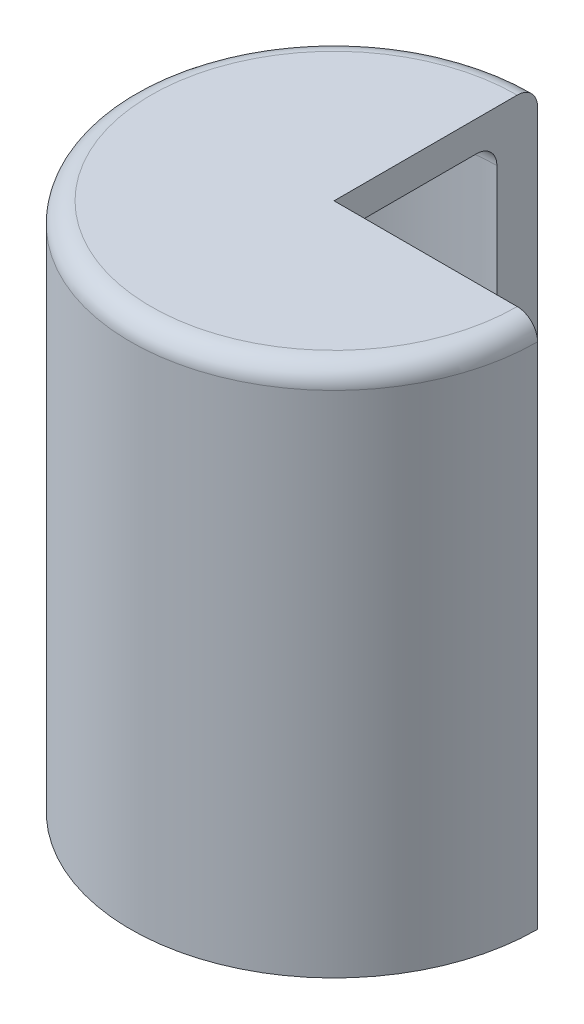
ISO-10303-21;
HEADER;
FILE_DESCRIPTION(('STEP AP214'),'2;1');
FILE_NAME('part.step','',(''),(''),'','','');
FILE_SCHEMA(('AUTOMOTIVE_DESIGN { 1 0 10303 214 1 1 1 1 }'));
ENDSEC;
DATA;
#1=APPLICATION_CONTEXT('core data for automotive mechanical design processes');
#2=APPLICATION_PROTOCOL_DEFINITION('international standard','automotive_design',2000,#1);
#3=PRODUCT_CONTEXT('',#1,'mechanical');
#4=PRODUCT('Part','Part','',(#3));
#5=PRODUCT_RELATED_PRODUCT_CATEGORY('part','',(#4));
#6=PRODUCT_DEFINITION_FORMATION('','',#4);
#7=PRODUCT_DEFINITION_CONTEXT('part definition',#1,'design');
#8=PRODUCT_DEFINITION('design','',#6,#7);
#9=PRODUCT_DEFINITION_SHAPE('','',#8);
#10=(LENGTH_UNIT() NAMED_UNIT(*) SI_UNIT(.MILLI.,.METRE.));
#11=(NAMED_UNIT(*) PLANE_ANGLE_UNIT() SI_UNIT($,.RADIAN.));
#12=(NAMED_UNIT(*) SI_UNIT($,.STERADIAN.) SOLID_ANGLE_UNIT());
#13=UNCERTAINTY_MEASURE_WITH_UNIT(LENGTH_MEASURE(1.E-05),#10,'distance_accuracy_value','');
#14=(GEOMETRIC_REPRESENTATION_CONTEXT(3) GLOBAL_UNCERTAINTY_ASSIGNED_CONTEXT((#13)) GLOBAL_UNIT_ASSIGNED_CONTEXT((#10,
#11,#12)) REPRESENTATION_CONTEXT('',''));
#15=CARTESIAN_POINT('',(0.,0.,0.));
#16=DIRECTION('',(0.,0.,1.));
#17=DIRECTION('',(1.,0.,0.));
#18=AXIS2_PLACEMENT_3D('',#15,#16,#17);
#19=CARTESIAN_POINT('',(0.,40.2884289109046,0.));
#20=DIRECTION('',(0.,1.,0.));
#21=DIRECTION('',(0.,0.,1.));
#22=AXIS2_PLACEMENT_3D('',#19,#20,#21);
#23=PLANE('',#22);
#24=CARTESIAN_POINT('',(0.,40.2884289109046,0.));
#25=DIRECTION('',(0.,1.,0.));
#26=DIRECTION('',(0.,0.,1.));
#27=AXIS2_PLACEMENT_3D('',#24,#25,#26);
#28=CIRCLE('',#27,70.);
#29=CARTESIAN_POINT('',(7.33211081157058E-13,40.2884289109046,-70.));
#30=VERTEX_POINT('',#29);
#31=CARTESIAN_POINT('',(70.,40.2884289109046,0.));
#32=VERTEX_POINT('',#31);
#33=EDGE_CURVE('E11',#30,#32,#28,.T.);
#34=ORIENTED_EDGE('',*,*,#33,.F.);
#35=DIRECTION('',(0.,0.,-1.));
#36=VECTOR('',#35,1.);
#37=CARTESIAN_POINT('',(0.,40.2884289109046,0.));
#38=LINE('',#37,#36);
#39=CARTESIAN_POINT('',(0.,40.2884289109046,0.));
#40=VERTEX_POINT('',#39);
#41=EDGE_CURVE('E107',#40,#30,#38,.T.);
#42=ORIENTED_EDGE('',*,*,#41,.F.);
#43=DIRECTION('',(1.,0.,0.));
#44=VECTOR('',#43,1.);
#45=CARTESIAN_POINT('',(0.,40.2884289109046,0.));
#46=LINE('',#45,#44);
#47=EDGE_CURVE('E106',#40,#32,#46,.T.);
#48=ORIENTED_EDGE('',*,*,#47,.T.);
#49=EDGE_LOOP('',(#34,#42,#48));
#50=FACE_BOUND('',#49,.T.);
#51=ADVANCED_FACE('F37',(#50),#23,.F.);
#52=CARTESIAN_POINT('',(0.,30.2884289109046,0.));
#53=DIRECTION('',(0.,1.,0.));
#54=DIRECTION('',(0.,0.,1.));
#55=AXIS2_PLACEMENT_3D('',#52,#53,#54);
#56=TOROIDAL_SURFACE('',#55,70.,10.);
#57=CARTESIAN_POINT('',(0.,30.2884289109046,0.));
#58=DIRECTION('',(0.,1.,0.));
#59=DIRECTION('',(0.,0.,1.));
#60=AXIS2_PLACEMENT_3D('',#57,#58,#59);
#61=CIRCLE('',#60,80.);
#62=CARTESIAN_POINT('',(8.37955521322352E-13,30.2884289109046,-80.));
#63=VERTEX_POINT('',#62);
#64=CARTESIAN_POINT('',(80.,30.2884289109046,0.));
#65=VERTEX_POINT('',#64);
#66=EDGE_CURVE('E44',#63,#65,#61,.T.);
#67=ORIENTED_EDGE('',*,*,#66,.F.);
#68=CARTESIAN_POINT('',(7.33211081157058E-13,30.2884289109046,-70.));
#69=DIRECTION('',(-1.,0.,0.));
#70=DIRECTION('',(0.,0.,-1.));
#71=AXIS2_PLACEMENT_3D('',#68,#69,#70);
#72=CIRCLE('',#71,10.);
#73=EDGE_CURVE('E102',#30,#63,#72,.T.);
#74=ORIENTED_EDGE('',*,*,#73,.F.);
#75=ORIENTED_EDGE('',*,*,#33,.T.);
#76=CARTESIAN_POINT('',(70.,30.2884289109046,0.));
#77=DIRECTION('',(0.,0.,-1.));
#78=DIRECTION('',(1.,0.,0.));
#79=AXIS2_PLACEMENT_3D('',#76,#77,#78);
#80=CIRCLE('',#79,10.);
#81=EDGE_CURVE('E99',#32,#65,#80,.T.);
#82=ORIENTED_EDGE('',*,*,#81,.T.);
#83=EDGE_LOOP('',(#67,#74,#75,#82));
#84=FACE_BOUND('',#83,.T.);
#85=ADVANCED_FACE('F97',(#84),#56,.F.);
#86=CARTESIAN_POINT('',(0.,40.2884289109046,0.));
#87=DIRECTION('',(0.,1.,0.));
#88=DIRECTION('',(0.,0.,1.));
#89=AXIS2_PLACEMENT_3D('',#86,#87,#88);
#90=CYLINDRICAL_SURFACE('',#89,80.);
#91=CARTESIAN_POINT('',(0.,-204.742322884468,0.));
#92=DIRECTION('',(0.,1.,0.));
#93=DIRECTION('',(0.,0.,1.));
#94=AXIS2_PLACEMENT_3D('',#91,#92,#93);
#95=CIRCLE('',#94,80.);
#96=CARTESIAN_POINT('',(8.37955521322352E-13,-204.742322884468,-80.));
#97=VERTEX_POINT('',#96);
#98=CARTESIAN_POINT('',(80.,-204.742322884468,0.));
#99=VERTEX_POINT('',#98);
#100=EDGE_CURVE('E150',#97,#99,#95,.T.);
#101=ORIENTED_EDGE('',*,*,#100,.F.);
#102=DIRECTION('',(0.,-1.,0.));
#103=VECTOR('',#102,1.);
#104=CARTESIAN_POINT('',(8.37955521322352E-13,30.2884289109046,-80.));
#105=LINE('',#104,#103);
#106=EDGE_CURVE('E131',#63,#97,#105,.T.);
#107=ORIENTED_EDGE('',*,*,#106,.F.);
#108=ORIENTED_EDGE('',*,*,#66,.T.);
#109=DIRECTION('',(0.,-1.,0.));
#110=VECTOR('',#109,1.);
#111=CARTESIAN_POINT('',(80.,30.2884289109046,0.));
#112=LINE('',#111,#110);
#113=EDGE_CURVE('E114',#65,#99,#112,.T.);
#114=ORIENTED_EDGE('',*,*,#113,.T.);
#115=EDGE_LOOP('',(#101,#107,#108,#114));
#116=FACE_BOUND('',#115,.T.);
#117=ADVANCED_FACE('F153',(#116),#90,.F.);
#118=CARTESIAN_POINT('',(8.37955521322352E-13,-204.742322884468,-80.));
#119=DIRECTION('',(0.,1.,0.));
#120=DIRECTION('',(0.,0.,1.));
#121=AXIS2_PLACEMENT_3D('',#118,#119,#120);
#122=PLANE('',#121);
#123=CARTESIAN_POINT('',(0.,-204.742322884468,0.));
#124=DIRECTION('',(0.,1.,0.));
#125=DIRECTION('',(0.,0.,1.));
#126=AXIS2_PLACEMENT_3D('',#123,#124,#125);
#127=CIRCLE('',#126,100.);
#128=CARTESIAN_POINT('',(1.04744440165294E-12,-204.742322884468,-100.));
#129=VERTEX_POINT('',#128);
#130=CARTESIAN_POINT('',(100.,-204.742322884468,0.));
#131=VERTEX_POINT('',#130);
#132=EDGE_CURVE('E148',#129,#131,#127,.T.);
#133=ORIENTED_EDGE('',*,*,#132,.F.);
#134=DIRECTION('',(0.,0.,-1.));
#135=VECTOR('',#134,1.);
#136=CARTESIAN_POINT('',(8.37955521322352E-13,-204.742322884468,-80.));
#137=LINE('',#136,#135);
#138=EDGE_CURVE('E134',#97,#129,#137,.T.);
#139=ORIENTED_EDGE('',*,*,#138,.F.);
#140=ORIENTED_EDGE('',*,*,#100,.T.);
#141=DIRECTION('',(1.,0.,0.));
#142=VECTOR('',#141,1.);
#143=CARTESIAN_POINT('',(80.,-204.742322884468,0.));
#144=LINE('',#143,#142);
#145=EDGE_CURVE('E116',#99,#131,#144,.T.);
#146=ORIENTED_EDGE('',*,*,#145,.T.);
#147=EDGE_LOOP('',(#133,#139,#140,#146));
#148=FACE_BOUND('',#147,.T.);
#149=ADVANCED_FACE('F164',(#148),#122,.F.);
#150=CARTESIAN_POINT('',(0.,40.2884289109046,0.));
#151=DIRECTION('',(0.,1.,0.));
#152=DIRECTION('',(0.,0.,1.));
#153=AXIS2_PLACEMENT_3D('',#150,#151,#152);
#154=CYLINDRICAL_SURFACE('',#153,100.);
#155=CARTESIAN_POINT('',(0.,45.2576771155317,0.));
#156=DIRECTION('',(0.,1.,0.));
#157=DIRECTION('',(0.,0.,1.));
#158=AXIS2_PLACEMENT_3D('',#155,#156,#157);
#159=CIRCLE('',#158,100.);
#160=CARTESIAN_POINT('',(1.04744440165294E-12,45.2576771155317,-100.));
#161=VERTEX_POINT('',#160);
#162=CARTESIAN_POINT('',(100.,45.2576771155317,0.));
#163=VERTEX_POINT('',#162);
#164=EDGE_CURVE('E146',#161,#163,#159,.T.);
#165=ORIENTED_EDGE('',*,*,#164,.F.);
#166=DIRECTION('',(0.,1.,0.));
#167=VECTOR('',#166,1.);
#168=CARTESIAN_POINT('',(1.04744440165294E-12,-204.742322884468,-100.));
#169=LINE('',#168,#167);
#170=EDGE_CURVE('E137',#129,#161,#169,.T.);
#171=ORIENTED_EDGE('',*,*,#170,.F.);
#172=ORIENTED_EDGE('',*,*,#132,.T.);
#173=DIRECTION('',(0.,1.,0.));
#174=VECTOR('',#173,1.);
#175=CARTESIAN_POINT('',(100.,-204.742322884468,0.));
#176=LINE('',#175,#174);
#177=EDGE_CURVE('E121',#131,#163,#176,.T.);
#178=ORIENTED_EDGE('',*,*,#177,.T.);
#179=EDGE_LOOP('',(#165,#171,#172,#178));
#180=FACE_BOUND('',#179,.T.);
#181=ADVANCED_FACE('F162',(#180),#154,.T.);
#182=CARTESIAN_POINT('',(0.,45.2576771155317,0.));
#183=DIRECTION('',(0.,1.,0.));
#184=DIRECTION('',(0.,0.,1.));
#185=AXIS2_PLACEMENT_3D('',#182,#183,#184);
#186=TOROIDAL_SURFACE('',#185,90.,10.);
#187=CARTESIAN_POINT('',(0.,55.2576771155317,0.));
#188=DIRECTION('',(0.,1.,0.));
#189=DIRECTION('',(0.,0.,1.));
#190=AXIS2_PLACEMENT_3D('',#187,#188,#189);
#191=CIRCLE('',#190,90.);
#192=CARTESIAN_POINT('',(9.42699961487646E-13,55.2576771155317,-90.));
#193=VERTEX_POINT('',#192);
#194=CARTESIAN_POINT('',(90.,55.2576771155317,0.));
#195=VERTEX_POINT('',#194);
#196=EDGE_CURVE('E58',#193,#195,#191,.T.);
#197=ORIENTED_EDGE('',*,*,#196,.F.);
#198=CARTESIAN_POINT('',(9.42699961487646E-13,45.2576771155317,-90.));
#199=DIRECTION('',(1.,0.,0.));
#200=DIRECTION('',(0.,0.,-1.));
#201=AXIS2_PLACEMENT_3D('',#198,#199,#200);
#202=CIRCLE('',#201,10.);
#203=EDGE_CURVE('E140',#161,#193,#202,.T.);
#204=ORIENTED_EDGE('',*,*,#203,.F.);
#205=ORIENTED_EDGE('',*,*,#164,.T.);
#206=CARTESIAN_POINT('',(90.,45.2576771155317,0.));
#207=DIRECTION('',(0.,0.,1.));
#208=DIRECTION('',(1.,0.,0.));
#209=AXIS2_PLACEMENT_3D('',#206,#207,#208);
#210=CIRCLE('',#209,10.);
#211=EDGE_CURVE('E124',#163,#195,#210,.T.);
#212=ORIENTED_EDGE('',*,*,#211,.T.);
#213=EDGE_LOOP('',(#197,#204,#205,#212));
#214=FACE_BOUND('',#213,.T.);
#215=ADVANCED_FACE('F159',(#214),#186,.T.);
#216=CARTESIAN_POINT('',(0.,55.2576771155317,0.));
#217=DIRECTION('',(0.,-1.,0.));
#218=DIRECTION('',(0.,0.,-1.));
#219=AXIS2_PLACEMENT_3D('',#216,#217,#218);
#220=PLANE('',#219);
#221=DIRECTION('',(0.,0.,1.));
#222=VECTOR('',#221,1.);
#223=CARTESIAN_POINT('',(0.,55.2576771155317,0.));
#224=LINE('',#223,#222);
#225=CARTESIAN_POINT('',(0.,55.2576771155317,0.));
#226=VERTEX_POINT('',#225);
#227=EDGE_CURVE('E142',#193,#226,#224,.T.);
#228=ORIENTED_EDGE('',*,*,#227,.F.);
#229=ORIENTED_EDGE('',*,*,#196,.T.);
#230=DIRECTION('',(-1.,0.,0.));
#231=VECTOR('',#230,1.);
#232=CARTESIAN_POINT('',(0.,55.2576771155317,0.));
#233=LINE('',#232,#231);
#234=EDGE_CURVE('E51',#195,#226,#233,.T.);
#235=ORIENTED_EDGE('',*,*,#234,.T.);
#236=EDGE_LOOP('',(#228,#229,#235));
#237=FACE_BOUND('',#236,.T.);
#238=ADVANCED_FACE('F165',(#237),#220,.F.);
#239=CARTESIAN_POINT('',(9.42699961487646E-13,45.2576771155317,-90.));
#240=DIRECTION('',(1.,0.,0.));
#241=DIRECTION('',(0.,0.,-1.));
#242=AXIS2_PLACEMENT_3D('',#239,#240,#241);
#243=PLANE('',#242);
#244=DIRECTION('',(0.,-1.,0.));
#245=VECTOR('',#244,1.);
#246=CARTESIAN_POINT('',(0.,40.2884289109046,0.));
#247=LINE('',#246,#245);
#248=EDGE_CURVE('E127',#226,#40,#247,.T.);
#249=ORIENTED_EDGE('',*,*,#248,.T.);
#250=ORIENTED_EDGE('',*,*,#41,.T.);
#251=ORIENTED_EDGE('',*,*,#73,.T.);
#252=ORIENTED_EDGE('',*,*,#106,.T.);
#253=ORIENTED_EDGE('',*,*,#138,.T.);
#254=ORIENTED_EDGE('',*,*,#170,.T.);
#255=ORIENTED_EDGE('',*,*,#203,.T.);
#256=ORIENTED_EDGE('',*,*,#227,.T.);
#257=EDGE_LOOP('',(#249,#250,#251,#252,#253,#254,#255,#256));
#258=FACE_BOUND('',#257,.T.);
#259=ADVANCED_FACE('F155',(#258),#243,.T.);
#260=CARTESIAN_POINT('',(90.,45.2576771155317,0.));
#261=DIRECTION('',(0.,0.,1.));
#262=DIRECTION('',(1.,0.,0.));
#263=AXIS2_PLACEMENT_3D('',#260,#261,#262);
#264=PLANE('',#263);
#265=ORIENTED_EDGE('',*,*,#248,.F.);
#266=ORIENTED_EDGE('',*,*,#234,.F.);
#267=ORIENTED_EDGE('',*,*,#211,.F.);
#268=ORIENTED_EDGE('',*,*,#177,.F.);
#269=ORIENTED_EDGE('',*,*,#145,.F.);
#270=ORIENTED_EDGE('',*,*,#113,.F.);
#271=ORIENTED_EDGE('',*,*,#81,.F.);
#272=ORIENTED_EDGE('',*,*,#47,.F.);
#273=EDGE_LOOP('',(#265,#266,#267,#268,#269,#270,#271,#272));
#274=FACE_BOUND('',#273,.T.);
#275=ADVANCED_FACE('F111',(#274),#264,.F.);
#276=CLOSED_SHELL('',(#51,#85,#117,#149,#181,#215,#238,#259,#275));
#277=MANIFOLD_SOLID_BREP('B2',#276);
#278=ADVANCED_BREP_SHAPE_REPRESENTATION('',(#18,#277),#14);
#279=SHAPE_DEFINITION_REPRESENTATION(#9,#278);
ENDSEC;
END-ISO-10303-21;
